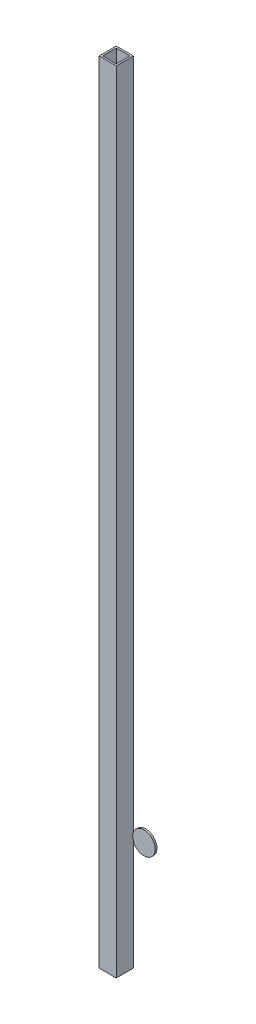
ISO-10303-21;
HEADER;
FILE_DESCRIPTION(('STEP AP214'),'2;1');
FILE_NAME('part.step','',(''),(''),'','','');
FILE_SCHEMA(('AUTOMOTIVE_DESIGN { 1 0 10303 214 1 1 1 1 }'));
ENDSEC;
DATA;
#1=APPLICATION_CONTEXT('core data for automotive mechanical design processes');
#2=APPLICATION_PROTOCOL_DEFINITION('international standard','automotive_design',2000,#1);
#3=PRODUCT_CONTEXT('',#1,'mechanical');
#4=PRODUCT('Part','Part','',(#3));
#5=PRODUCT_RELATED_PRODUCT_CATEGORY('part','',(#4));
#6=PRODUCT_DEFINITION_FORMATION('','',#4);
#7=PRODUCT_DEFINITION_CONTEXT('part definition',#1,'design');
#8=PRODUCT_DEFINITION('design','',#6,#7);
#9=PRODUCT_DEFINITION_SHAPE('','',#8);
#10=(LENGTH_UNIT() NAMED_UNIT(*) SI_UNIT(.MILLI.,.METRE.));
#11=(NAMED_UNIT(*) PLANE_ANGLE_UNIT() SI_UNIT($,.RADIAN.));
#12=(NAMED_UNIT(*) SI_UNIT($,.STERADIAN.) SOLID_ANGLE_UNIT());
#13=UNCERTAINTY_MEASURE_WITH_UNIT(LENGTH_MEASURE(1.E-05),#10,'distance_accuracy_value','');
#14=(GEOMETRIC_REPRESENTATION_CONTEXT(3) GLOBAL_UNCERTAINTY_ASSIGNED_CONTEXT((#13)) GLOBAL_UNIT_ASSIGNED_CONTEXT((#10,
#11,#12)) REPRESENTATION_CONTEXT('',''));
#15=CARTESIAN_POINT('',(0.,0.,0.));
#16=DIRECTION('',(0.,0.,1.));
#17=DIRECTION('',(1.,0.,0.));
#18=AXIS2_PLACEMENT_3D('',#15,#16,#17);
#19=CARTESIAN_POINT('',(16.8319794557304,169.526516715406,1.27));
#20=DIRECTION('',(0.,0.,-1.));
#21=DIRECTION('',(-1.,0.,0.));
#22=AXIS2_PLACEMENT_3D('',#19,#20,#21);
#23=CYLINDRICAL_SURFACE('',#22,16.6423047133307);
#24=CARTESIAN_POINT('',(16.8319794557304,169.526516715406,1.27));
#25=DIRECTION('',(0.,0.,1.));
#26=DIRECTION('',(1.,0.,0.));
#27=AXIS2_PLACEMENT_3D('',#24,#25,#26);
#28=CIRCLE('',#27,16.6423047133307);
#29=CARTESIAN_POINT('',(33.4742841690611,169.526516715406,1.27));
#30=VERTEX_POINT('',#29);
#31=EDGE_CURVE('E12',#30,#30,#28,.T.);
#32=ORIENTED_EDGE('',*,*,#31,.F.);
#33=EDGE_LOOP('',(#32));
#34=FACE_BOUND('',#33,.T.);
#35=CARTESIAN_POINT('',(16.8319794557304,169.526516715406,-1.27));
#36=DIRECTION('',(0.,0.,1.));
#37=DIRECTION('',(1.,0.,0.));
#38=AXIS2_PLACEMENT_3D('',#35,#36,#37);
#39=CIRCLE('',#38,16.6423047133307);
#40=CARTESIAN_POINT('',(33.4742841690611,169.526516715406,-1.27));
#41=VERTEX_POINT('',#40);
#42=EDGE_CURVE('E68',#41,#41,#39,.T.);
#43=ORIENTED_EDGE('',*,*,#42,.T.);
#44=EDGE_LOOP('',(#43));
#45=FACE_BOUND('',#44,.T.);
#46=ADVANCED_FACE('F65',(#34,#45),#23,.T.);
#47=CARTESIAN_POINT('',(16.8319794557304,169.526516715406,1.27));
#48=DIRECTION('',(0.,0.,1.));
#49=DIRECTION('',(1.,0.,0.));
#50=AXIS2_PLACEMENT_3D('',#47,#48,#49);
#51=PLANE('',#50);
#52=ORIENTED_EDGE('',*,*,#31,.T.);
#53=EDGE_LOOP('',(#52));
#54=FACE_BOUND('',#53,.T.);
#55=ADVANCED_FACE('F80',(#54),#51,.T.);
#56=CARTESIAN_POINT('',(16.8319794557304,169.526516715406,-1.27));
#57=DIRECTION('',(0.,0.,1.));
#58=DIRECTION('',(1.,0.,0.));
#59=AXIS2_PLACEMENT_3D('',#56,#57,#58);
#60=PLANE('',#59);
#61=ORIENTED_EDGE('',*,*,#42,.F.);
#62=EDGE_LOOP('',(#61));
#63=FACE_BOUND('',#62,.T.);
#64=ADVANCED_FACE('F78',(#63),#60,.F.);
#65=CLOSED_SHELL('',(#46,#55,#64));
#66=MANIFOLD_SOLID_BREP('B2',#65);
#67=CARTESIAN_POINT('',(-2.54,1168.4,2.54));
#68=DIRECTION('',(0.,0.,1.));
#69=DIRECTION('',(1.,0.,0.));
#70=AXIS2_PLACEMENT_3D('',#67,#68,#69);
#71=PLANE('',#70);
#72=DIRECTION('',(-1.,0.,0.));
#73=VECTOR('',#72,1.);
#74=CARTESIAN_POINT('',(-2.54,0.,2.54));
#75=LINE('',#74,#73);
#76=CARTESIAN_POINT('',(-2.54,0.,2.54));
#77=VERTEX_POINT('',#76);
#78=CARTESIAN_POINT('',(-22.86,0.,2.54));
#79=VERTEX_POINT('',#78);
#80=EDGE_CURVE('E211',#77,#79,#75,.T.);
#81=ORIENTED_EDGE('',*,*,#80,.F.);
#82=DIRECTION('',(0.,-1.,0.));
#83=VECTOR('',#82,1.);
#84=CARTESIAN_POINT('',(-2.54,1168.4,2.54));
#85=LINE('',#84,#83);
#86=CARTESIAN_POINT('',(-2.54,1168.4,2.54));
#87=VERTEX_POINT('',#86);
#88=EDGE_CURVE('E63',#87,#77,#85,.T.);
#89=ORIENTED_EDGE('',*,*,#88,.F.);
#90=DIRECTION('',(-1.,0.,0.));
#91=VECTOR('',#90,1.);
#92=CARTESIAN_POINT('',(-2.54,1168.4,2.54));
#93=LINE('',#92,#91);
#94=CARTESIAN_POINT('',(-22.86,1168.4,2.54));
#95=VERTEX_POINT('',#94);
#96=EDGE_CURVE('E193',#87,#95,#93,.T.);
#97=ORIENTED_EDGE('',*,*,#96,.T.);
#98=DIRECTION('',(0.,-1.,0.));
#99=VECTOR('',#98,1.);
#100=CARTESIAN_POINT('',(-22.86,1168.4,2.54));
#101=LINE('',#100,#99);
#102=EDGE_CURVE('E124',#95,#79,#101,.T.);
#103=ORIENTED_EDGE('',*,*,#102,.T.);
#104=EDGE_LOOP('',(#81,#89,#97,#103));
#105=FACE_BOUND('',#104,.T.);
#106=ADVANCED_FACE('F105',(#105),#71,.T.);
#107=CARTESIAN_POINT('',(-2.54,1168.4,2.54));
#108=DIRECTION('',(-1.,0.,0.));
#109=DIRECTION('',(0.,0.,1.));
#110=AXIS2_PLACEMENT_3D('',#107,#108,#109);
#111=PLANE('',#110);
#112=DIRECTION('',(0.,0.,-1.));
#113=VECTOR('',#112,1.);
#114=CARTESIAN_POINT('',(-2.54,0.,2.54));
#115=LINE('',#114,#113);
#116=CARTESIAN_POINT('',(-2.54,0.,22.86));
#117=VERTEX_POINT('',#116);
#118=EDGE_CURVE('E182',#117,#77,#115,.T.);
#119=ORIENTED_EDGE('',*,*,#118,.F.);
#120=DIRECTION('',(0.,-1.,0.));
#121=VECTOR('',#120,1.);
#122=CARTESIAN_POINT('',(-2.54,1168.4,22.86));
#123=LINE('',#122,#121);
#124=CARTESIAN_POINT('',(-2.54,1168.4,22.86));
#125=VERTEX_POINT('',#124);
#126=EDGE_CURVE('E115',#125,#117,#123,.T.);
#127=ORIENTED_EDGE('',*,*,#126,.F.);
#128=DIRECTION('',(0.,0.,-1.));
#129=VECTOR('',#128,1.);
#130=CARTESIAN_POINT('',(-2.54,1168.4,2.54));
#131=LINE('',#130,#129);
#132=EDGE_CURVE('E180',#125,#87,#131,.T.);
#133=ORIENTED_EDGE('',*,*,#132,.T.);
#134=ORIENTED_EDGE('',*,*,#88,.T.);
#135=EDGE_LOOP('',(#119,#127,#133,#134));
#136=FACE_BOUND('',#135,.T.);
#137=ADVANCED_FACE('F179',(#136),#111,.T.);
#138=CARTESIAN_POINT('',(-2.54,1168.4,22.86));
#139=DIRECTION('',(0.,0.,-1.));
#140=DIRECTION('',(-1.,0.,0.));
#141=AXIS2_PLACEMENT_3D('',#138,#139,#140);
#142=PLANE('',#141);
#143=DIRECTION('',(1.,0.,0.));
#144=VECTOR('',#143,1.);
#145=CARTESIAN_POINT('',(-2.54,0.,22.86));
#146=LINE('',#145,#144);
#147=CARTESIAN_POINT('',(-22.86,0.,22.86));
#148=VERTEX_POINT('',#147);
#149=EDGE_CURVE('E214',#148,#117,#146,.T.);
#150=ORIENTED_EDGE('',*,*,#149,.F.);
#151=DIRECTION('',(0.,-1.,0.));
#152=VECTOR('',#151,1.);
#153=CARTESIAN_POINT('',(-22.86,1168.4,22.86));
#154=LINE('',#153,#152);
#155=CARTESIAN_POINT('',(-22.86,1168.4,22.86));
#156=VERTEX_POINT('',#155);
#157=EDGE_CURVE('E149',#156,#148,#154,.T.);
#158=ORIENTED_EDGE('',*,*,#157,.F.);
#159=DIRECTION('',(1.,0.,0.));
#160=VECTOR('',#159,1.);
#161=CARTESIAN_POINT('',(-2.54,1168.4,22.86));
#162=LINE('',#161,#160);
#163=EDGE_CURVE('E192',#156,#125,#162,.T.);
#164=ORIENTED_EDGE('',*,*,#163,.T.);
#165=ORIENTED_EDGE('',*,*,#126,.T.);
#166=EDGE_LOOP('',(#150,#158,#164,#165));
#167=FACE_BOUND('',#166,.T.);
#168=ADVANCED_FACE('F195',(#167),#142,.T.);
#169=CARTESIAN_POINT('',(0.,1168.4,0.));
#170=DIRECTION('',(-1.,0.,0.));
#171=DIRECTION('',(0.,0.,1.));
#172=AXIS2_PLACEMENT_3D('',#169,#170,#171);
#173=PLANE('',#172);
#174=DIRECTION('',(0.,0.,-1.));
#175=VECTOR('',#174,1.);
#176=CARTESIAN_POINT('',(0.,0.,0.));
#177=LINE('',#176,#175);
#178=CARTESIAN_POINT('',(0.,0.,25.4));
#179=VERTEX_POINT('',#178);
#180=CARTESIAN_POINT('',(0.,0.,0.));
#181=VERTEX_POINT('',#180);
#182=EDGE_CURVE('E202',#179,#181,#177,.T.);
#183=ORIENTED_EDGE('',*,*,#182,.T.);
#184=DIRECTION('',(0.,-1.,0.));
#185=VECTOR('',#184,1.);
#186=CARTESIAN_POINT('',(0.,1168.4,0.));
#187=LINE('',#186,#185);
#188=CARTESIAN_POINT('',(0.,1168.4,0.));
#189=VERTEX_POINT('',#188);
#190=EDGE_CURVE('E109',#189,#181,#187,.T.);
#191=ORIENTED_EDGE('',*,*,#190,.F.);
#192=DIRECTION('',(0.,0.,-1.));
#193=VECTOR('',#192,1.);
#194=CARTESIAN_POINT('',(0.,1168.4,0.));
#195=LINE('',#194,#193);
#196=CARTESIAN_POINT('',(0.,1168.4,25.4));
#197=VERTEX_POINT('',#196);
#198=EDGE_CURVE('E219',#197,#189,#195,.T.);
#199=ORIENTED_EDGE('',*,*,#198,.F.);
#200=DIRECTION('',(0.,-1.,0.));
#201=VECTOR('',#200,1.);
#202=CARTESIAN_POINT('',(0.,1168.4,25.4));
#203=LINE('',#202,#201);
#204=EDGE_CURVE('E198',#197,#179,#203,.T.);
#205=ORIENTED_EDGE('',*,*,#204,.T.);
#206=EDGE_LOOP('',(#183,#191,#199,#205));
#207=FACE_BOUND('',#206,.T.);
#208=ADVANCED_FACE('F107',(#207),#173,.F.);
#209=CARTESIAN_POINT('',(0.,1168.4,0.));
#210=DIRECTION('',(0.,0.,1.));
#211=DIRECTION('',(1.,0.,0.));
#212=AXIS2_PLACEMENT_3D('',#209,#210,#211);
#213=PLANE('',#212);
#214=DIRECTION('',(-1.,0.,0.));
#215=VECTOR('',#214,1.);
#216=CARTESIAN_POINT('',(0.,0.,0.));
#217=LINE('',#216,#215);
#218=CARTESIAN_POINT('',(-25.4,0.,0.));
#219=VERTEX_POINT('',#218);
#220=EDGE_CURVE('E205',#181,#219,#217,.T.);
#221=ORIENTED_EDGE('',*,*,#220,.T.);
#222=DIRECTION('',(0.,-1.,0.));
#223=VECTOR('',#222,1.);
#224=CARTESIAN_POINT('',(-25.4,1168.4,0.));
#225=LINE('',#224,#223);
#226=CARTESIAN_POINT('',(-25.4,1168.4,0.));
#227=VERTEX_POINT('',#226);
#228=EDGE_CURVE('E226',#227,#219,#225,.T.);
#229=ORIENTED_EDGE('',*,*,#228,.F.);
#230=DIRECTION('',(-1.,0.,0.));
#231=VECTOR('',#230,1.);
#232=CARTESIAN_POINT('',(0.,1168.4,0.));
#233=LINE('',#232,#231);
#234=EDGE_CURVE('E162',#189,#227,#233,.T.);
#235=ORIENTED_EDGE('',*,*,#234,.F.);
#236=ORIENTED_EDGE('',*,*,#190,.T.);
#237=EDGE_LOOP('',(#221,#229,#235,#236));
#238=FACE_BOUND('',#237,.T.);
#239=ADVANCED_FACE('F232',(#238),#213,.F.);
#240=CARTESIAN_POINT('',(-25.4,1168.4,0.));
#241=DIRECTION('',(1.,0.,0.));
#242=DIRECTION('',(0.,0.,-1.));
#243=AXIS2_PLACEMENT_3D('',#240,#241,#242);
#244=PLANE('',#243);
#245=DIRECTION('',(0.,0.,1.));
#246=VECTOR('',#245,1.);
#247=CARTESIAN_POINT('',(-25.4,0.,0.));
#248=LINE('',#247,#246);
#249=CARTESIAN_POINT('',(-25.4,0.,25.4));
#250=VERTEX_POINT('',#249);
#251=EDGE_CURVE('E207',#219,#250,#248,.T.);
#252=ORIENTED_EDGE('',*,*,#251,.T.);
#253=DIRECTION('',(0.,-1.,0.));
#254=VECTOR('',#253,1.);
#255=CARTESIAN_POINT('',(-25.4,1168.4,25.4));
#256=LINE('',#255,#254);
#257=CARTESIAN_POINT('',(-25.4,1168.4,25.4));
#258=VERTEX_POINT('',#257);
#259=EDGE_CURVE('E224',#258,#250,#256,.T.);
#260=ORIENTED_EDGE('',*,*,#259,.F.);
#261=DIRECTION('',(0.,0.,1.));
#262=VECTOR('',#261,1.);
#263=CARTESIAN_POINT('',(-25.4,1168.4,0.));
#264=LINE('',#263,#262);
#265=EDGE_CURVE('E248',#227,#258,#264,.T.);
#266=ORIENTED_EDGE('',*,*,#265,.F.);
#267=ORIENTED_EDGE('',*,*,#228,.T.);
#268=EDGE_LOOP('',(#252,#260,#266,#267));
#269=FACE_BOUND('',#268,.T.);
#270=ADVANCED_FACE('F242',(#269),#244,.F.);
#271=CARTESIAN_POINT('',(0.,1168.4,25.4));
#272=DIRECTION('',(0.,0.,-1.));
#273=DIRECTION('',(-1.,0.,0.));
#274=AXIS2_PLACEMENT_3D('',#271,#272,#273);
#275=PLANE('',#274);
#276=DIRECTION('',(1.,0.,0.));
#277=VECTOR('',#276,1.);
#278=CARTESIAN_POINT('',(0.,0.,25.4));
#279=LINE('',#278,#277);
#280=EDGE_CURVE('E209',#250,#179,#279,.T.);
#281=ORIENTED_EDGE('',*,*,#280,.T.);
#282=ORIENTED_EDGE('',*,*,#204,.F.);
#283=DIRECTION('',(1.,0.,0.));
#284=VECTOR('',#283,1.);
#285=CARTESIAN_POINT('',(0.,1168.4,25.4));
#286=LINE('',#285,#284);
#287=EDGE_CURVE('E246',#258,#197,#286,.T.);
#288=ORIENTED_EDGE('',*,*,#287,.F.);
#289=ORIENTED_EDGE('',*,*,#259,.T.);
#290=EDGE_LOOP('',(#281,#282,#288,#289));
#291=FACE_BOUND('',#290,.T.);
#292=ADVANCED_FACE('F245',(#291),#275,.F.);
#293=CARTESIAN_POINT('',(-22.86,1168.4,2.54));
#294=DIRECTION('',(1.,0.,0.));
#295=DIRECTION('',(0.,0.,-1.));
#296=AXIS2_PLACEMENT_3D('',#293,#294,#295);
#297=PLANE('',#296);
#298=DIRECTION('',(0.,0.,1.));
#299=VECTOR('',#298,1.);
#300=CARTESIAN_POINT('',(-22.86,0.,2.54));
#301=LINE('',#300,#299);
#302=EDGE_CURVE('E216',#79,#148,#301,.T.);
#303=ORIENTED_EDGE('',*,*,#302,.F.);
#304=ORIENTED_EDGE('',*,*,#102,.F.);
#305=DIRECTION('',(0.,0.,1.));
#306=VECTOR('',#305,1.);
#307=CARTESIAN_POINT('',(-22.86,1168.4,2.54));
#308=LINE('',#307,#306);
#309=EDGE_CURVE('E196',#95,#156,#308,.T.);
#310=ORIENTED_EDGE('',*,*,#309,.T.);
#311=ORIENTED_EDGE('',*,*,#157,.T.);
#312=EDGE_LOOP('',(#303,#304,#310,#311));
#313=FACE_BOUND('',#312,.T.);
#314=ADVANCED_FACE('F254',(#313),#297,.T.);
#315=CARTESIAN_POINT('',(0.,1168.4,0.));
#316=DIRECTION('',(0.,-1.,0.));
#317=DIRECTION('',(0.,0.,-1.));
#318=AXIS2_PLACEMENT_3D('',#315,#316,#317);
#319=PLANE('',#318);
#320=ORIENTED_EDGE('',*,*,#198,.T.);
#321=ORIENTED_EDGE('',*,*,#234,.T.);
#322=ORIENTED_EDGE('',*,*,#265,.T.);
#323=ORIENTED_EDGE('',*,*,#287,.T.);
#324=EDGE_LOOP('',(#320,#321,#322,#323));
#325=FACE_BOUND('',#324,.T.);
#326=ORIENTED_EDGE('',*,*,#96,.F.);
#327=ORIENTED_EDGE('',*,*,#132,.F.);
#328=ORIENTED_EDGE('',*,*,#163,.F.);
#329=ORIENTED_EDGE('',*,*,#309,.F.);
#330=EDGE_LOOP('',(#326,#327,#328,#329));
#331=FACE_BOUND('',#330,.T.);
#332=ADVANCED_FACE('F190',(#325,#331),#319,.F.);
#333=CARTESIAN_POINT('',(0.,0.,0.));
#334=DIRECTION('',(0.,-1.,0.));
#335=DIRECTION('',(0.,0.,-1.));
#336=AXIS2_PLACEMENT_3D('',#333,#334,#335);
#337=PLANE('',#336);
#338=ORIENTED_EDGE('',*,*,#182,.F.);
#339=ORIENTED_EDGE('',*,*,#280,.F.);
#340=ORIENTED_EDGE('',*,*,#251,.F.);
#341=ORIENTED_EDGE('',*,*,#220,.F.);
#342=EDGE_LOOP('',(#338,#339,#340,#341));
#343=FACE_BOUND('',#342,.T.);
#344=ORIENTED_EDGE('',*,*,#80,.T.);
#345=ORIENTED_EDGE('',*,*,#302,.T.);
#346=ORIENTED_EDGE('',*,*,#149,.T.);
#347=ORIENTED_EDGE('',*,*,#118,.T.);
#348=EDGE_LOOP('',(#344,#345,#346,#347));
#349=FACE_BOUND('',#348,.T.);
#350=ADVANCED_FACE('F239',(#343,#349),#337,.T.);
#351=CLOSED_SHELL('',(#106,#137,#168,#208,#239,#270,#292,#314,#332,#350));
#352=MANIFOLD_SOLID_BREP('B7',#351);
#353=ADVANCED_BREP_SHAPE_REPRESENTATION('',(#18,#66,#352),#14);
#354=SHAPE_DEFINITION_REPRESENTATION(#9,#353);
ENDSEC;
END-ISO-10303-21;
